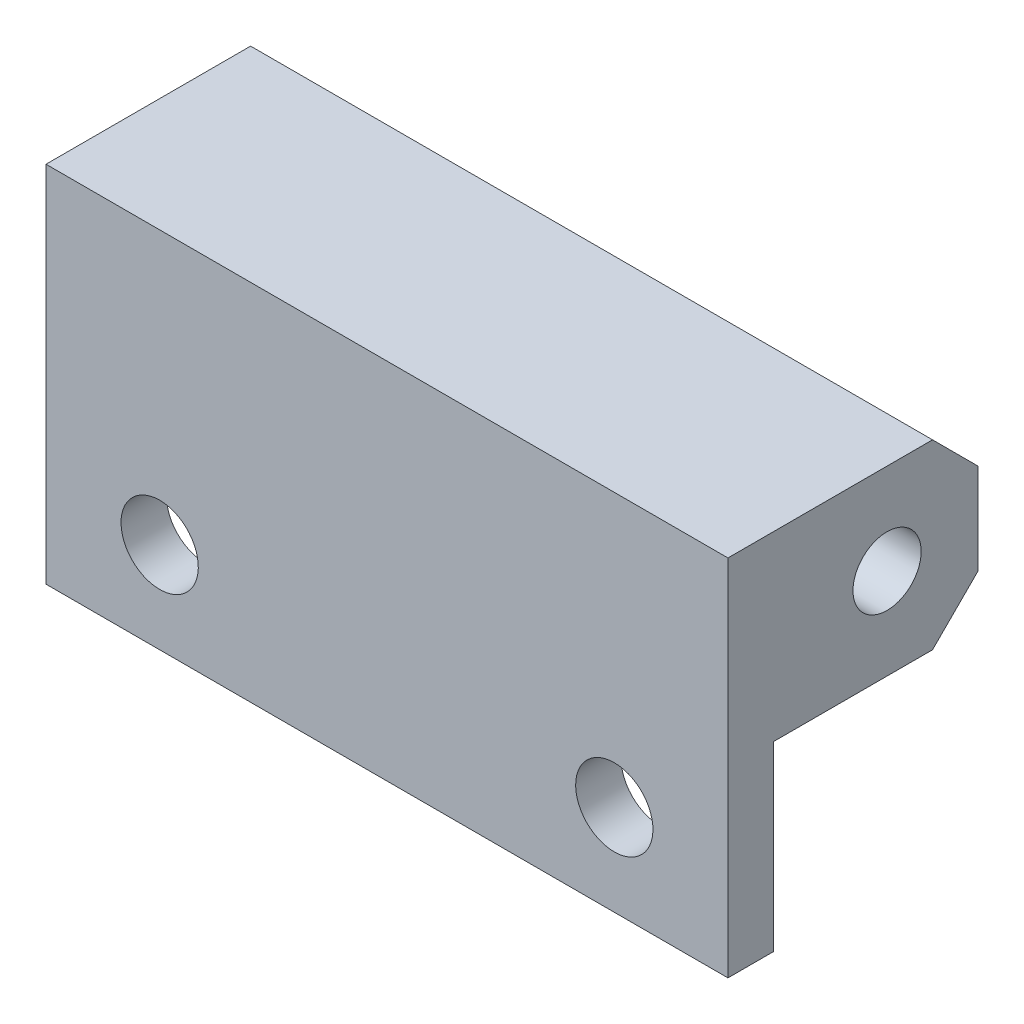
ISO-10303-21;
HEADER;
FILE_DESCRIPTION(('STEP AP214'),'2;1');
FILE_NAME('part.step','',(''),(''),'','','');
FILE_SCHEMA(('AUTOMOTIVE_DESIGN { 1 0 10303 214 1 1 1 1 }'));
ENDSEC;
DATA;
#1=APPLICATION_CONTEXT('core data for automotive mechanical design processes');
#2=APPLICATION_PROTOCOL_DEFINITION('international standard','automotive_design',2000,#1);
#3=PRODUCT_CONTEXT('',#1,'mechanical');
#4=PRODUCT('Part','Part','',(#3));
#5=PRODUCT_RELATED_PRODUCT_CATEGORY('part','',(#4));
#6=PRODUCT_DEFINITION_FORMATION('','',#4);
#7=PRODUCT_DEFINITION_CONTEXT('part definition',#1,'design');
#8=PRODUCT_DEFINITION('design','',#6,#7);
#9=PRODUCT_DEFINITION_SHAPE('','',#8);
#10=(LENGTH_UNIT() NAMED_UNIT(*) SI_UNIT(.MILLI.,.METRE.));
#11=(NAMED_UNIT(*) PLANE_ANGLE_UNIT() SI_UNIT($,.RADIAN.));
#12=(NAMED_UNIT(*) SI_UNIT($,.STERADIAN.) SOLID_ANGLE_UNIT());
#13=UNCERTAINTY_MEASURE_WITH_UNIT(LENGTH_MEASURE(1.E-05),#10,'distance_accuracy_value','');
#14=(GEOMETRIC_REPRESENTATION_CONTEXT(3) GLOBAL_UNCERTAINTY_ASSIGNED_CONTEXT((#13)) GLOBAL_UNIT_ASSIGNED_CONTEXT((#10,
#11,#12)) REPRESENTATION_CONTEXT('',''));
#15=CARTESIAN_POINT('',(0.,0.,0.));
#16=DIRECTION('',(0.,0.,1.));
#17=DIRECTION('',(1.,0.,0.));
#18=AXIS2_PLACEMENT_3D('',#15,#16,#17);
#19=CARTESIAN_POINT('',(15.,-4.,-2.));
#20=DIRECTION('',(0.,0.707106781186547,0.707106781186548));
#21=DIRECTION('',(0.,-0.707106781186548,0.707106781186547));
#22=AXIS2_PLACEMENT_3D('',#19,#20,#21);
#23=PLANE('',#22);
#24=DIRECTION('',(0.,0.707106781186548,-0.707106781186547));
#25=VECTOR('',#24,1.);
#26=CARTESIAN_POINT('',(-15.,-4.,-2.));
#27=LINE('',#26,#25);
#28=CARTESIAN_POINT('',(-15.,-4.,-2.));
#29=VERTEX_POINT('',#28);
#30=CARTESIAN_POINT('',(-15.,-2.,-4.));
#31=VERTEX_POINT('',#30);
#32=EDGE_CURVE('E131',#29,#31,#27,.T.);
#33=ORIENTED_EDGE('',*,*,#32,.T.);
#34=DIRECTION('',(-1.,0.,0.));
#35=VECTOR('',#34,1.);
#36=CARTESIAN_POINT('',(15.,-2.,-4.));
#37=LINE('',#36,#35);
#38=CARTESIAN_POINT('',(15.,-2.,-4.));
#39=VERTEX_POINT('',#38);
#40=EDGE_CURVE('E11',#39,#31,#37,.T.);
#41=ORIENTED_EDGE('',*,*,#40,.F.);
#42=DIRECTION('',(0.,0.707106781186548,-0.707106781186547));
#43=VECTOR('',#42,1.);
#44=CARTESIAN_POINT('',(15.,-4.,-2.));
#45=LINE('',#44,#43);
#46=CARTESIAN_POINT('',(15.,-4.,-2.));
#47=VERTEX_POINT('',#46);
#48=EDGE_CURVE('E151',#47,#39,#45,.T.);
#49=ORIENTED_EDGE('',*,*,#48,.F.);
#50=DIRECTION('',(-1.,0.,0.));
#51=VECTOR('',#50,1.);
#52=CARTESIAN_POINT('',(15.,-4.,-2.));
#53=LINE('',#52,#51);
#54=EDGE_CURVE('E50',#47,#29,#53,.T.);
#55=ORIENTED_EDGE('',*,*,#54,.T.);
#56=EDGE_LOOP('',(#33,#41,#49,#55));
#57=FACE_BOUND('',#56,.T.);
#58=ADVANCED_FACE('F34',(#57),#23,.F.);
#59=CARTESIAN_POINT('',(15.,-2.,-4.));
#60=DIRECTION('',(0.,0.,1.));
#61=DIRECTION('',(1.,0.,0.));
#62=AXIS2_PLACEMENT_3D('',#59,#60,#61);
#63=PLANE('',#62);
#64=DIRECTION('',(0.,1.,0.));
#65=VECTOR('',#64,1.);
#66=CARTESIAN_POINT('',(-15.,-2.,-4.));
#67=LINE('',#66,#65);
#68=CARTESIAN_POINT('',(-15.,2.,-4.));
#69=VERTEX_POINT('',#68);
#70=EDGE_CURVE('E133',#31,#69,#67,.T.);
#71=ORIENTED_EDGE('',*,*,#70,.T.);
#72=DIRECTION('',(-1.,0.,0.));
#73=VECTOR('',#72,1.);
#74=CARTESIAN_POINT('',(15.,2.,-4.));
#75=LINE('',#74,#73);
#76=CARTESIAN_POINT('',(15.,2.,-4.));
#77=VERTEX_POINT('',#76);
#78=EDGE_CURVE('E42',#77,#69,#75,.T.);
#79=ORIENTED_EDGE('',*,*,#78,.F.);
#80=DIRECTION('',(0.,1.,0.));
#81=VECTOR('',#80,1.);
#82=CARTESIAN_POINT('',(15.,-2.,-4.));
#83=LINE('',#82,#81);
#84=EDGE_CURVE('E88',#39,#77,#83,.T.);
#85=ORIENTED_EDGE('',*,*,#84,.F.);
#86=ORIENTED_EDGE('',*,*,#40,.T.);
#87=EDGE_LOOP('',(#71,#79,#85,#86));
#88=FACE_BOUND('',#87,.T.);
#89=ADVANCED_FACE('F209',(#88),#63,.F.);
#90=CARTESIAN_POINT('',(15.,2.,-4.));
#91=DIRECTION('',(0.,-0.707106781186548,0.707106781186547));
#92=DIRECTION('',(0.,-0.707106781186547,-0.707106781186548));
#93=AXIS2_PLACEMENT_3D('',#90,#91,#92);
#94=PLANE('',#93);
#95=DIRECTION('',(0.,0.707106781186547,0.707106781186548));
#96=VECTOR('',#95,1.);
#97=CARTESIAN_POINT('',(-15.,2.,-4.));
#98=LINE('',#97,#96);
#99=CARTESIAN_POINT('',(-15.,4.,-2.));
#100=VERTEX_POINT('',#99);
#101=EDGE_CURVE('E136',#69,#100,#98,.T.);
#102=ORIENTED_EDGE('',*,*,#101,.T.);
#103=DIRECTION('',(-1.,0.,0.));
#104=VECTOR('',#103,1.);
#105=CARTESIAN_POINT('',(15.,4.,-2.));
#106=LINE('',#105,#104);
#107=CARTESIAN_POINT('',(15.,4.,-2.));
#108=VERTEX_POINT('',#107);
#109=EDGE_CURVE('E157',#108,#100,#106,.T.);
#110=ORIENTED_EDGE('',*,*,#109,.F.);
#111=DIRECTION('',(0.,0.707106781186547,0.707106781186548));
#112=VECTOR('',#111,1.);
#113=CARTESIAN_POINT('',(15.,2.,-4.));
#114=LINE('',#113,#112);
#115=EDGE_CURVE('E164',#77,#108,#114,.T.);
#116=ORIENTED_EDGE('',*,*,#115,.F.);
#117=ORIENTED_EDGE('',*,*,#78,.T.);
#118=EDGE_LOOP('',(#102,#110,#116,#117));
#119=FACE_BOUND('',#118,.T.);
#120=ADVANCED_FACE('F162',(#119),#94,.F.);
#121=CARTESIAN_POINT('',(15.,4.,7.));
#122=DIRECTION('',(0.,1.,0.));
#123=DIRECTION('',(0.,0.,1.));
#124=AXIS2_PLACEMENT_3D('',#121,#122,#123);
#125=PLANE('',#124);
#126=DIRECTION('',(0.,0.,-1.));
#127=VECTOR('',#126,1.);
#128=CARTESIAN_POINT('',(-15.,4.,7.));
#129=LINE('',#128,#127);
#130=CARTESIAN_POINT('',(-15.,4.,7.));
#131=VERTEX_POINT('',#130);
#132=EDGE_CURVE('E139',#131,#100,#129,.T.);
#133=ORIENTED_EDGE('',*,*,#132,.F.);
#134=DIRECTION('',(-1.,0.,0.));
#135=VECTOR('',#134,1.);
#136=CARTESIAN_POINT('',(15.,4.,7.));
#137=LINE('',#136,#135);
#138=CARTESIAN_POINT('',(15.,4.,7.));
#139=VERTEX_POINT('',#138);
#140=EDGE_CURVE('E155',#139,#131,#137,.T.);
#141=ORIENTED_EDGE('',*,*,#140,.F.);
#142=DIRECTION('',(0.,0.,-1.));
#143=VECTOR('',#142,1.);
#144=CARTESIAN_POINT('',(15.,4.,7.));
#145=LINE('',#144,#143);
#146=EDGE_CURVE('E172',#139,#108,#145,.T.);
#147=ORIENTED_EDGE('',*,*,#146,.T.);
#148=ORIENTED_EDGE('',*,*,#109,.T.);
#149=EDGE_LOOP('',(#133,#141,#147,#148));
#150=FACE_BOUND('',#149,.T.);
#151=ADVANCED_FACE('F170',(#150),#125,.T.);
#152=CARTESIAN_POINT('',(15.,-12.,7.));
#153=DIRECTION('',(0.,0.,1.));
#154=DIRECTION('',(0.,-1.,0.));
#155=AXIS2_PLACEMENT_3D('',#152,#153,#154);
#156=PLANE('',#155);
#157=CARTESIAN_POINT('',(10.,-8.,7.));
#158=DIRECTION('',(0.,0.,-1.));
#159=DIRECTION('',(0.,1.,0.));
#160=AXIS2_PLACEMENT_3D('',#157,#158,#159);
#161=CIRCLE('',#160,1.7);
#162=CARTESIAN_POINT('',(10.,-6.3,7.));
#163=VERTEX_POINT('',#162);
#164=EDGE_CURVE('E183',#163,#163,#161,.T.);
#165=ORIENTED_EDGE('',*,*,#164,.T.);
#166=EDGE_LOOP('',(#165));
#167=FACE_BOUND('',#166,.T.);
#168=CARTESIAN_POINT('',(-10.,-8.,7.));
#169=DIRECTION('',(0.,0.,-1.));
#170=DIRECTION('',(0.,1.,0.));
#171=AXIS2_PLACEMENT_3D('',#168,#169,#170);
#172=CIRCLE('',#171,1.7);
#173=CARTESIAN_POINT('',(-10.,-6.3,7.));
#174=VERTEX_POINT('',#173);
#175=EDGE_CURVE('E134',#174,#174,#172,.T.);
#176=ORIENTED_EDGE('',*,*,#175,.T.);
#177=EDGE_LOOP('',(#176));
#178=FACE_BOUND('',#177,.T.);
#179=DIRECTION('',(0.,1.,0.));
#180=VECTOR('',#179,1.);
#181=CARTESIAN_POINT('',(-15.,-12.,7.));
#182=LINE('',#181,#180);
#183=CARTESIAN_POINT('',(-15.,-12.,7.));
#184=VERTEX_POINT('',#183);
#185=EDGE_CURVE('E142',#184,#131,#182,.T.);
#186=ORIENTED_EDGE('',*,*,#185,.F.);
#187=DIRECTION('',(-1.,0.,0.));
#188=VECTOR('',#187,1.);
#189=CARTESIAN_POINT('',(15.,-12.,7.));
#190=LINE('',#189,#188);
#191=CARTESIAN_POINT('',(15.,-12.,7.));
#192=VERTEX_POINT('',#191);
#193=EDGE_CURVE('E113',#192,#184,#190,.T.);
#194=ORIENTED_EDGE('',*,*,#193,.F.);
#195=DIRECTION('',(0.,1.,0.));
#196=VECTOR('',#195,1.);
#197=CARTESIAN_POINT('',(15.,-12.,7.));
#198=LINE('',#197,#196);
#199=EDGE_CURVE('E123',#192,#139,#198,.T.);
#200=ORIENTED_EDGE('',*,*,#199,.T.);
#201=ORIENTED_EDGE('',*,*,#140,.T.);
#202=EDGE_LOOP('',(#186,#194,#200,#201));
#203=FACE_BOUND('',#202,.T.);
#204=ADVANCED_FACE('F229',(#167,#178,#203),#156,.T.);
#205=CARTESIAN_POINT('',(15.,-12.,5.));
#206=DIRECTION('',(0.,-1.,0.));
#207=DIRECTION('',(0.,0.,-1.));
#208=AXIS2_PLACEMENT_3D('',#205,#206,#207);
#209=PLANE('',#208);
#210=DIRECTION('',(0.,0.,1.));
#211=VECTOR('',#210,1.);
#212=CARTESIAN_POINT('',(-15.,-12.,5.));
#213=LINE('',#212,#211);
#214=CARTESIAN_POINT('',(-15.,-12.,5.));
#215=VERTEX_POINT('',#214);
#216=EDGE_CURVE('E109',#215,#184,#213,.T.);
#217=ORIENTED_EDGE('',*,*,#216,.F.);
#218=DIRECTION('',(-1.,0.,0.));
#219=VECTOR('',#218,1.);
#220=CARTESIAN_POINT('',(15.,-12.,5.));
#221=LINE('',#220,#219);
#222=CARTESIAN_POINT('',(15.,-12.,5.));
#223=VERTEX_POINT('',#222);
#224=EDGE_CURVE('E104',#223,#215,#221,.T.);
#225=ORIENTED_EDGE('',*,*,#224,.F.);
#226=DIRECTION('',(0.,0.,1.));
#227=VECTOR('',#226,1.);
#228=CARTESIAN_POINT('',(15.,-12.,5.));
#229=LINE('',#228,#227);
#230=EDGE_CURVE('E107',#223,#192,#229,.T.);
#231=ORIENTED_EDGE('',*,*,#230,.T.);
#232=ORIENTED_EDGE('',*,*,#193,.T.);
#233=EDGE_LOOP('',(#217,#225,#231,#232));
#234=FACE_BOUND('',#233,.T.);
#235=ADVANCED_FACE('F106',(#234),#209,.T.);
#236=CARTESIAN_POINT('',(15.,-4.,5.));
#237=DIRECTION('',(0.,0.,-1.));
#238=DIRECTION('',(0.,1.,0.));
#239=AXIS2_PLACEMENT_3D('',#236,#237,#238);
#240=PLANE('',#239);
#241=CARTESIAN_POINT('',(10.,-8.,5.));
#242=DIRECTION('',(0.,0.,-1.));
#243=DIRECTION('',(0.,1.,0.));
#244=AXIS2_PLACEMENT_3D('',#241,#242,#243);
#245=CIRCLE('',#244,1.7);
#246=CARTESIAN_POINT('',(10.,-6.3,5.));
#247=VERTEX_POINT('',#246);
#248=EDGE_CURVE('E186',#247,#247,#245,.T.);
#249=ORIENTED_EDGE('',*,*,#248,.F.);
#250=EDGE_LOOP('',(#249));
#251=FACE_BOUND('',#250,.T.);
#252=CARTESIAN_POINT('',(-10.,-8.,5.));
#253=DIRECTION('',(0.,0.,-1.));
#254=DIRECTION('',(0.,1.,0.));
#255=AXIS2_PLACEMENT_3D('',#252,#253,#254);
#256=CIRCLE('',#255,1.7);
#257=CARTESIAN_POINT('',(-10.,-6.3,5.));
#258=VERTEX_POINT('',#257);
#259=EDGE_CURVE('E180',#258,#258,#256,.T.);
#260=ORIENTED_EDGE('',*,*,#259,.F.);
#261=EDGE_LOOP('',(#260));
#262=FACE_BOUND('',#261,.T.);
#263=DIRECTION('',(0.,-1.,0.));
#264=VECTOR('',#263,1.);
#265=CARTESIAN_POINT('',(-15.,-4.,5.));
#266=LINE('',#265,#264);
#267=CARTESIAN_POINT('',(-15.,-4.,5.));
#268=VERTEX_POINT('',#267);
#269=EDGE_CURVE('E146',#268,#215,#266,.T.);
#270=ORIENTED_EDGE('',*,*,#269,.F.);
#271=DIRECTION('',(-1.,0.,0.));
#272=VECTOR('',#271,1.);
#273=CARTESIAN_POINT('',(15.,-4.,5.));
#274=LINE('',#273,#272);
#275=CARTESIAN_POINT('',(15.,-4.,5.));
#276=VERTEX_POINT('',#275);
#277=EDGE_CURVE('E76',#276,#268,#274,.T.);
#278=ORIENTED_EDGE('',*,*,#277,.F.);
#279=DIRECTION('',(0.,-1.,0.));
#280=VECTOR('',#279,1.);
#281=CARTESIAN_POINT('',(15.,-4.,5.));
#282=LINE('',#281,#280);
#283=EDGE_CURVE('E120',#276,#223,#282,.T.);
#284=ORIENTED_EDGE('',*,*,#283,.T.);
#285=ORIENTED_EDGE('',*,*,#224,.T.);
#286=EDGE_LOOP('',(#270,#278,#284,#285));
#287=FACE_BOUND('',#286,.T.);
#288=ADVANCED_FACE('F125',(#251,#262,#287),#240,.T.);
#289=CARTESIAN_POINT('',(15.,-4.,-2.));
#290=DIRECTION('',(0.,-1.,0.));
#291=DIRECTION('',(0.,0.,-1.));
#292=AXIS2_PLACEMENT_3D('',#289,#290,#291);
#293=PLANE('',#292);
#294=DIRECTION('',(0.,0.,1.));
#295=VECTOR('',#294,1.);
#296=CARTESIAN_POINT('',(-15.,-4.,-2.));
#297=LINE('',#296,#295);
#298=EDGE_CURVE('E148',#29,#268,#297,.T.);
#299=ORIENTED_EDGE('',*,*,#298,.F.);
#300=ORIENTED_EDGE('',*,*,#54,.F.);
#301=DIRECTION('',(0.,0.,1.));
#302=VECTOR('',#301,1.);
#303=CARTESIAN_POINT('',(15.,-4.,-2.));
#304=LINE('',#303,#302);
#305=EDGE_CURVE('E126',#47,#276,#304,.T.);
#306=ORIENTED_EDGE('',*,*,#305,.T.);
#307=ORIENTED_EDGE('',*,*,#277,.T.);
#308=EDGE_LOOP('',(#299,#300,#306,#307));
#309=FACE_BOUND('',#308,.T.);
#310=ADVANCED_FACE('F214',(#309),#293,.T.);
#311=CARTESIAN_POINT('',(15.,0.,0.));
#312=DIRECTION('',(1.,0.,0.));
#313=DIRECTION('',(0.,0.,-1.));
#314=AXIS2_PLACEMENT_3D('',#311,#312,#313);
#315=PLANE('',#314);
#316=CARTESIAN_POINT('',(15.,0.,0.));
#317=DIRECTION('',(1.,0.,0.));
#318=DIRECTION('',(0.,0.,-1.));
#319=AXIS2_PLACEMENT_3D('',#316,#317,#318);
#320=CIRCLE('',#319,1.5);
#321=CARTESIAN_POINT('',(15.,0.,-1.5));
#322=VERTEX_POINT('',#321);
#323=EDGE_CURVE('E189',#322,#322,#320,.T.);
#324=ORIENTED_EDGE('',*,*,#323,.F.);
#325=EDGE_LOOP('',(#324));
#326=FACE_BOUND('',#325,.T.);
#327=ORIENTED_EDGE('',*,*,#48,.T.);
#328=ORIENTED_EDGE('',*,*,#84,.T.);
#329=ORIENTED_EDGE('',*,*,#115,.T.);
#330=ORIENTED_EDGE('',*,*,#146,.F.);
#331=ORIENTED_EDGE('',*,*,#199,.F.);
#332=ORIENTED_EDGE('',*,*,#230,.F.);
#333=ORIENTED_EDGE('',*,*,#283,.F.);
#334=ORIENTED_EDGE('',*,*,#305,.F.);
#335=EDGE_LOOP('',(#327,#328,#329,#330,#331,#332,#333,#334));
#336=FACE_BOUND('',#335,.T.);
#337=ADVANCED_FACE('F118',(#326,#336),#315,.T.);
#338=CARTESIAN_POINT('',(-15.,0.,0.));
#339=DIRECTION('',(1.,0.,0.));
#340=DIRECTION('',(0.,0.,-1.));
#341=AXIS2_PLACEMENT_3D('',#338,#339,#340);
#342=PLANE('',#341);
#343=CARTESIAN_POINT('',(-15.,0.,0.));
#344=DIRECTION('',(1.,0.,0.));
#345=DIRECTION('',(0.,0.,-1.));
#346=AXIS2_PLACEMENT_3D('',#343,#344,#345);
#347=CIRCLE('',#346,1.5);
#348=CARTESIAN_POINT('',(-15.,0.,-1.5));
#349=VERTEX_POINT('',#348);
#350=EDGE_CURVE('E192',#349,#349,#347,.T.);
#351=ORIENTED_EDGE('',*,*,#350,.T.);
#352=EDGE_LOOP('',(#351));
#353=FACE_BOUND('',#352,.T.);
#354=ORIENTED_EDGE('',*,*,#32,.F.);
#355=ORIENTED_EDGE('',*,*,#298,.T.);
#356=ORIENTED_EDGE('',*,*,#269,.T.);
#357=ORIENTED_EDGE('',*,*,#216,.T.);
#358=ORIENTED_EDGE('',*,*,#185,.T.);
#359=ORIENTED_EDGE('',*,*,#132,.T.);
#360=ORIENTED_EDGE('',*,*,#101,.F.);
#361=ORIENTED_EDGE('',*,*,#70,.F.);
#362=EDGE_LOOP('',(#354,#355,#356,#357,#358,#359,#360,#361));
#363=FACE_BOUND('',#362,.T.);
#364=ADVANCED_FACE('F166',(#353,#363),#342,.F.);
#365=CARTESIAN_POINT('',(-10.,-8.,5.));
#366=DIRECTION('',(0.,0.,-1.));
#367=DIRECTION('',(0.,1.,0.));
#368=AXIS2_PLACEMENT_3D('',#365,#366,#367);
#369=CYLINDRICAL_SURFACE('',#368,1.7);
#370=ORIENTED_EDGE('',*,*,#175,.F.);
#371=EDGE_LOOP('',(#370));
#372=FACE_BOUND('',#371,.T.);
#373=ORIENTED_EDGE('',*,*,#259,.T.);
#374=EDGE_LOOP('',(#373));
#375=FACE_BOUND('',#374,.T.);
#376=ADVANCED_FACE('F205',(#372,#375),#369,.F.);
#377=CARTESIAN_POINT('',(10.,-8.,5.));
#378=DIRECTION('',(0.,0.,-1.));
#379=DIRECTION('',(0.,1.,0.));
#380=AXIS2_PLACEMENT_3D('',#377,#378,#379);
#381=CYLINDRICAL_SURFACE('',#380,1.7);
#382=ORIENTED_EDGE('',*,*,#164,.F.);
#383=EDGE_LOOP('',(#382));
#384=FACE_BOUND('',#383,.T.);
#385=ORIENTED_EDGE('',*,*,#248,.T.);
#386=EDGE_LOOP('',(#385));
#387=FACE_BOUND('',#386,.T.);
#388=ADVANCED_FACE('F199',(#384,#387),#381,.F.);
#389=CARTESIAN_POINT('',(-15.,0.,0.));
#390=DIRECTION('',(1.,0.,0.));
#391=DIRECTION('',(0.,0.,-1.));
#392=AXIS2_PLACEMENT_3D('',#389,#390,#391);
#393=CYLINDRICAL_SURFACE('',#392,1.5);
#394=ORIENTED_EDGE('',*,*,#323,.T.);
#395=EDGE_LOOP('',(#394));
#396=FACE_BOUND('',#395,.T.);
#397=ORIENTED_EDGE('',*,*,#350,.F.);
#398=EDGE_LOOP('',(#397));
#399=FACE_BOUND('',#398,.T.);
#400=ADVANCED_FACE('F197',(#396,#399),#393,.F.);
#401=CLOSED_SHELL('',(#58,#89,#120,#151,#204,#235,#288,#310,#337,#364,#376,#388,#400));
#402=MANIFOLD_SOLID_BREP('B2',#401);
#403=ADVANCED_BREP_SHAPE_REPRESENTATION('',(#18,#402),#14);
#404=SHAPE_DEFINITION_REPRESENTATION(#9,#403);
ENDSEC;
END-ISO-10303-21;
